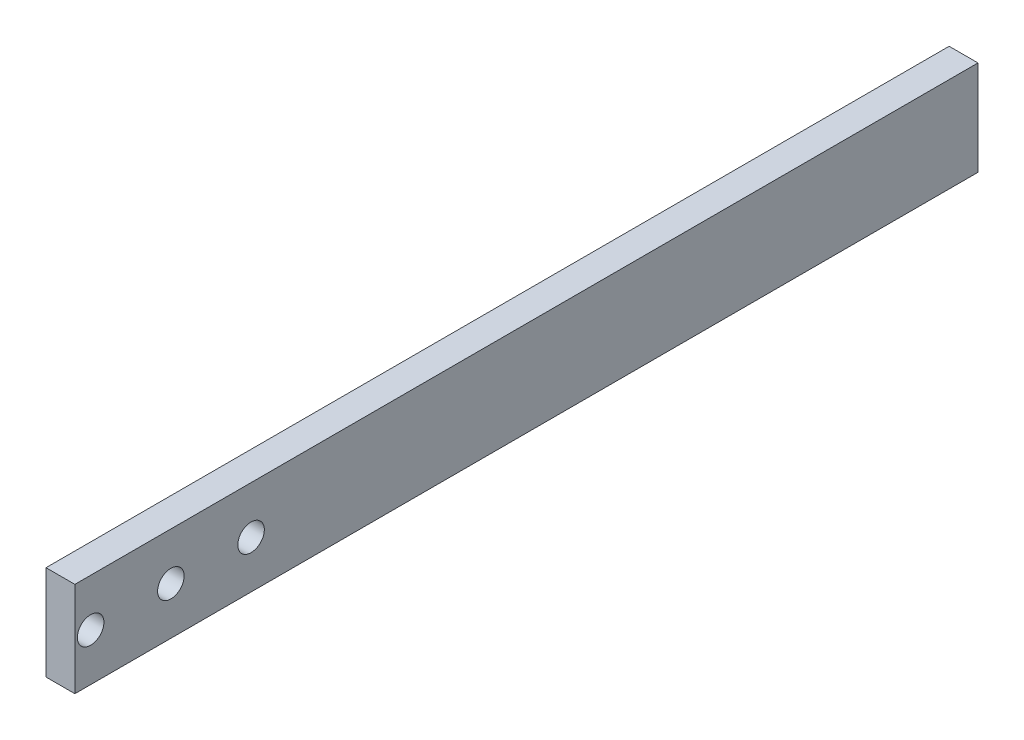
ISO-10303-21;
HEADER;
FILE_DESCRIPTION(('STEP AP214'),'2;1');
FILE_NAME('part.step','',(''),(''),'','','');
FILE_SCHEMA(('AUTOMOTIVE_DESIGN { 1 0 10303 214 1 1 1 1 }'));
ENDSEC;
DATA;
#1=APPLICATION_CONTEXT('core data for automotive mechanical design processes');
#2=APPLICATION_PROTOCOL_DEFINITION('international standard','automotive_design',2000,#1);
#3=PRODUCT_CONTEXT('',#1,'mechanical');
#4=PRODUCT('Part','Part','',(#3));
#5=PRODUCT_RELATED_PRODUCT_CATEGORY('part','',(#4));
#6=PRODUCT_DEFINITION_FORMATION('','',#4);
#7=PRODUCT_DEFINITION_CONTEXT('part definition',#1,'design');
#8=PRODUCT_DEFINITION('design','',#6,#7);
#9=PRODUCT_DEFINITION_SHAPE('','',#8);
#10=(LENGTH_UNIT() NAMED_UNIT(*) SI_UNIT(.MILLI.,.METRE.));
#11=(NAMED_UNIT(*) PLANE_ANGLE_UNIT() SI_UNIT($,.RADIAN.));
#12=(NAMED_UNIT(*) SI_UNIT($,.STERADIAN.) SOLID_ANGLE_UNIT());
#13=UNCERTAINTY_MEASURE_WITH_UNIT(LENGTH_MEASURE(1.E-05),#10,'distance_accuracy_value','');
#14=(GEOMETRIC_REPRESENTATION_CONTEXT(3) GLOBAL_UNCERTAINTY_ASSIGNED_CONTEXT((#13)) GLOBAL_UNIT_ASSIGNED_CONTEXT((#10,
#11,#12)) REPRESENTATION_CONTEXT('',''));
#15=CARTESIAN_POINT('',(0.,0.,0.));
#16=DIRECTION('',(0.,0.,1.));
#17=DIRECTION('',(1.,0.,0.));
#18=AXIS2_PLACEMENT_3D('',#15,#16,#17);
#19=CARTESIAN_POINT('',(-45.43,18.,-125.));
#20=DIRECTION('',(0.,0.,-1.));
#21=DIRECTION('',(-1.,0.,0.));
#22=AXIS2_PLACEMENT_3D('',#19,#20,#21);
#23=PLANE('',#22);
#24=DIRECTION('',(0.,-1.,0.));
#25=VECTOR('',#24,1.);
#26=CARTESIAN_POINT('',(-50.,18.,-125.));
#27=LINE('',#26,#25);
#28=CARTESIAN_POINT('',(-50.,18.,-125.));
#29=VERTEX_POINT('',#28);
#30=CARTESIAN_POINT('',(-50.,2.99999999999999,-125.));
#31=VERTEX_POINT('',#30);
#32=EDGE_CURVE('E98',#29,#31,#27,.T.);
#33=ORIENTED_EDGE('',*,*,#32,.T.);
#34=DIRECTION('',(-1.,0.,0.));
#35=VECTOR('',#34,1.);
#36=CARTESIAN_POINT('',(-40.,3.,-125.));
#37=LINE('',#36,#35);
#38=CARTESIAN_POINT('',(-45.43,3.,-125.));
#39=VERTEX_POINT('',#38);
#40=EDGE_CURVE('E55',#39,#31,#37,.T.);
#41=ORIENTED_EDGE('',*,*,#40,.F.);
#42=DIRECTION('',(0.,-1.,0.));
#43=VECTOR('',#42,1.);
#44=CARTESIAN_POINT('',(-45.43,18.,-125.));
#45=LINE('',#44,#43);
#46=CARTESIAN_POINT('',(-45.43,18.,-125.));
#47=VERTEX_POINT('',#46);
#48=EDGE_CURVE('E11',#47,#39,#45,.T.);
#49=ORIENTED_EDGE('',*,*,#48,.F.);
#50=DIRECTION('',(1.,0.,0.));
#51=VECTOR('',#50,1.);
#52=CARTESIAN_POINT('',(-45.43,18.,-125.));
#53=LINE('',#52,#51);
#54=EDGE_CURVE('E107',#29,#47,#53,.T.);
#55=ORIENTED_EDGE('',*,*,#54,.F.);
#56=EDGE_LOOP('',(#33,#41,#49,#55));
#57=FACE_BOUND('',#56,.T.);
#58=ADVANCED_FACE('F41',(#57),#23,.F.);
#59=CARTESIAN_POINT('',(-45.43,18.,-268.));
#60=DIRECTION('',(-1.,0.,0.));
#61=DIRECTION('',(0.,0.,1.));
#62=AXIS2_PLACEMENT_3D('',#59,#60,#61);
#63=PLANE('',#62);
#64=CARTESIAN_POINT('',(-45.43,10.5,-127.5));
#65=DIRECTION('',(-1.,0.,0.));
#66=DIRECTION('',(0.,0.,1.));
#67=AXIS2_PLACEMENT_3D('',#64,#65,#66);
#68=CIRCLE('',#67,2.09999999999999);
#69=CARTESIAN_POINT('',(-45.43,10.5,-125.4));
#70=VERTEX_POINT('',#69);
#71=EDGE_CURVE('E109',#70,#70,#68,.T.);
#72=ORIENTED_EDGE('',*,*,#71,.T.);
#73=EDGE_LOOP('',(#72));
#74=FACE_BOUND('',#73,.T.);
#75=CARTESIAN_POINT('',(-45.43,10.5,-140.2));
#76=DIRECTION('',(-1.,0.,0.));
#77=DIRECTION('',(0.,0.,1.));
#78=AXIS2_PLACEMENT_3D('',#75,#76,#77);
#79=CIRCLE('',#78,2.09999999999999);
#80=CARTESIAN_POINT('',(-45.43,10.5,-138.1));
#81=VERTEX_POINT('',#80);
#82=EDGE_CURVE('E112',#81,#81,#79,.T.);
#83=ORIENTED_EDGE('',*,*,#82,.T.);
#84=EDGE_LOOP('',(#83));
#85=FACE_BOUND('',#84,.T.);
#86=CARTESIAN_POINT('',(-45.43,10.5,-152.9));
#87=DIRECTION('',(-1.,0.,0.));
#88=DIRECTION('',(0.,0.,1.));
#89=AXIS2_PLACEMENT_3D('',#86,#87,#88);
#90=CIRCLE('',#89,2.09999999999999);
#91=CARTESIAN_POINT('',(-45.43,10.5,-150.8));
#92=VERTEX_POINT('',#91);
#93=EDGE_CURVE('E115',#92,#92,#90,.T.);
#94=ORIENTED_EDGE('',*,*,#93,.T.);
#95=EDGE_LOOP('',(#94));
#96=FACE_BOUND('',#95,.T.);
#97=ORIENTED_EDGE('',*,*,#48,.T.);
#98=DIRECTION('',(0.,0.,-1.));
#99=VECTOR('',#98,1.);
#100=CARTESIAN_POINT('',(-45.43,2.99999999999998,-268.));
#101=LINE('',#100,#99);
#102=CARTESIAN_POINT('',(-45.43,2.99999999999998,-268.));
#103=VERTEX_POINT('',#102);
#104=EDGE_CURVE('E95',#39,#103,#101,.T.);
#105=ORIENTED_EDGE('',*,*,#104,.T.);
#106=DIRECTION('',(0.,-1.,0.));
#107=VECTOR('',#106,1.);
#108=CARTESIAN_POINT('',(-45.43,18.,-268.));
#109=LINE('',#108,#107);
#110=CARTESIAN_POINT('',(-45.43,18.,-268.));
#111=VERTEX_POINT('',#110);
#112=EDGE_CURVE('E48',#111,#103,#109,.T.);
#113=ORIENTED_EDGE('',*,*,#112,.F.);
#114=DIRECTION('',(0.,0.,-1.));
#115=VECTOR('',#114,1.);
#116=CARTESIAN_POINT('',(-45.43,18.,-268.));
#117=LINE('',#116,#115);
#118=EDGE_CURVE('E105',#47,#111,#117,.T.);
#119=ORIENTED_EDGE('',*,*,#118,.F.);
#120=EDGE_LOOP('',(#97,#105,#113,#119));
#121=FACE_BOUND('',#120,.T.);
#122=ADVANCED_FACE('F129',(#74,#85,#96,#121),#63,.F.);
#123=CARTESIAN_POINT('',(-50.,18.,-268.));
#124=DIRECTION('',(0.,0.,1.));
#125=DIRECTION('',(1.,0.,0.));
#126=AXIS2_PLACEMENT_3D('',#123,#124,#125);
#127=PLANE('',#126);
#128=ORIENTED_EDGE('',*,*,#112,.T.);
#129=DIRECTION('',(-1.,0.,0.));
#130=VECTOR('',#129,1.);
#131=CARTESIAN_POINT('',(-50.,2.99999999999998,-268.));
#132=LINE('',#131,#130);
#133=CARTESIAN_POINT('',(-50.,2.99999999999998,-268.));
#134=VERTEX_POINT('',#133);
#135=EDGE_CURVE('E82',#103,#134,#132,.T.);
#136=ORIENTED_EDGE('',*,*,#135,.T.);
#137=DIRECTION('',(0.,-1.,0.));
#138=VECTOR('',#137,1.);
#139=CARTESIAN_POINT('',(-50.,18.,-268.));
#140=LINE('',#139,#138);
#141=CARTESIAN_POINT('',(-50.,18.,-268.));
#142=VERTEX_POINT('',#141);
#143=EDGE_CURVE('E93',#142,#134,#140,.T.);
#144=ORIENTED_EDGE('',*,*,#143,.F.);
#145=DIRECTION('',(-1.,0.,0.));
#146=VECTOR('',#145,1.);
#147=CARTESIAN_POINT('',(-50.,18.,-268.));
#148=LINE('',#147,#146);
#149=EDGE_CURVE('E103',#111,#142,#148,.T.);
#150=ORIENTED_EDGE('',*,*,#149,.F.);
#151=EDGE_LOOP('',(#128,#136,#144,#150));
#152=FACE_BOUND('',#151,.T.);
#153=ADVANCED_FACE('F91',(#152),#127,.F.);
#154=CARTESIAN_POINT('',(-50.,18.,-268.));
#155=DIRECTION('',(1.,0.,0.));
#156=DIRECTION('',(0.,0.,-1.));
#157=AXIS2_PLACEMENT_3D('',#154,#155,#156);
#158=PLANE('',#157);
#159=CARTESIAN_POINT('',(-50.,10.5,-127.5));
#160=DIRECTION('',(-1.,0.,0.));
#161=DIRECTION('',(0.,0.,1.));
#162=AXIS2_PLACEMENT_3D('',#159,#160,#161);
#163=CIRCLE('',#162,2.09999999999999);
#164=CARTESIAN_POINT('',(-50.,10.5,-125.4));
#165=VERTEX_POINT('',#164);
#166=EDGE_CURVE('E118',#165,#165,#163,.T.);
#167=ORIENTED_EDGE('',*,*,#166,.F.);
#168=EDGE_LOOP('',(#167));
#169=FACE_BOUND('',#168,.T.);
#170=CARTESIAN_POINT('',(-50.,10.5,-140.2));
#171=DIRECTION('',(-1.,0.,0.));
#172=DIRECTION('',(0.,0.,1.));
#173=AXIS2_PLACEMENT_3D('',#170,#171,#172);
#174=CIRCLE('',#173,2.09999999999999);
#175=CARTESIAN_POINT('',(-50.,10.5,-138.1));
#176=VERTEX_POINT('',#175);
#177=EDGE_CURVE('E122',#176,#176,#174,.T.);
#178=ORIENTED_EDGE('',*,*,#177,.F.);
#179=EDGE_LOOP('',(#178));
#180=FACE_BOUND('',#179,.T.);
#181=CARTESIAN_POINT('',(-50.,10.5,-152.9));
#182=DIRECTION('',(-1.,0.,0.));
#183=DIRECTION('',(0.,0.,1.));
#184=AXIS2_PLACEMENT_3D('',#181,#182,#183);
#185=CIRCLE('',#184,2.09999999999999);
#186=CARTESIAN_POINT('',(-50.,10.5,-150.8));
#187=VERTEX_POINT('',#186);
#188=EDGE_CURVE('E119',#187,#187,#185,.T.);
#189=ORIENTED_EDGE('',*,*,#188,.F.);
#190=EDGE_LOOP('',(#189));
#191=FACE_BOUND('',#190,.T.);
#192=ORIENTED_EDGE('',*,*,#143,.T.);
#193=DIRECTION('',(0.,0.,-1.));
#194=VECTOR('',#193,1.);
#195=CARTESIAN_POINT('',(-50.,3.,-125.));
#196=LINE('',#195,#194);
#197=EDGE_CURVE('E79',#31,#134,#196,.T.);
#198=ORIENTED_EDGE('',*,*,#197,.F.);
#199=ORIENTED_EDGE('',*,*,#32,.F.);
#200=DIRECTION('',(0.,0.,1.));
#201=VECTOR('',#200,1.);
#202=CARTESIAN_POINT('',(-50.,18.,-268.));
#203=LINE('',#202,#201);
#204=EDGE_CURVE('E63',#142,#29,#203,.T.);
#205=ORIENTED_EDGE('',*,*,#204,.F.);
#206=EDGE_LOOP('',(#192,#198,#199,#205));
#207=FACE_BOUND('',#206,.T.);
#208=ADVANCED_FACE('F97',(#169,#180,#191,#207),#158,.F.);
#209=CARTESIAN_POINT('',(0.,18.,0.));
#210=DIRECTION('',(0.,1.,0.));
#211=DIRECTION('',(0.,0.,1.));
#212=AXIS2_PLACEMENT_3D('',#209,#210,#211);
#213=PLANE('',#212);
#214=ORIENTED_EDGE('',*,*,#54,.T.);
#215=ORIENTED_EDGE('',*,*,#118,.T.);
#216=ORIENTED_EDGE('',*,*,#149,.T.);
#217=ORIENTED_EDGE('',*,*,#204,.T.);
#218=EDGE_LOOP('',(#214,#215,#216,#217));
#219=FACE_BOUND('',#218,.T.);
#220=ADVANCED_FACE('F133',(#219),#213,.T.);
#221=CARTESIAN_POINT('',(-32.,10.5,-152.9));
#222=DIRECTION('',(-1.,0.,0.));
#223=DIRECTION('',(0.,0.,1.));
#224=AXIS2_PLACEMENT_3D('',#221,#222,#223);
#225=CYLINDRICAL_SURFACE('',#224,2.09999999999999);
#226=ORIENTED_EDGE('',*,*,#188,.T.);
#227=EDGE_LOOP('',(#226));
#228=FACE_BOUND('',#227,.T.);
#229=ORIENTED_EDGE('',*,*,#93,.F.);
#230=EDGE_LOOP('',(#229));
#231=FACE_BOUND('',#230,.T.);
#232=ADVANCED_FACE('F135',(#228,#231),#225,.F.);
#233=CARTESIAN_POINT('',(-32.,10.5,-140.2));
#234=DIRECTION('',(-1.,0.,0.));
#235=DIRECTION('',(0.,0.,1.));
#236=AXIS2_PLACEMENT_3D('',#233,#234,#235);
#237=CYLINDRICAL_SURFACE('',#236,2.09999999999999);
#238=ORIENTED_EDGE('',*,*,#177,.T.);
#239=EDGE_LOOP('',(#238));
#240=FACE_BOUND('',#239,.T.);
#241=ORIENTED_EDGE('',*,*,#82,.F.);
#242=EDGE_LOOP('',(#241));
#243=FACE_BOUND('',#242,.T.);
#244=ADVANCED_FACE('F140',(#240,#243),#237,.F.);
#245=CARTESIAN_POINT('',(-32.,10.5,-127.5));
#246=DIRECTION('',(-1.,0.,0.));
#247=DIRECTION('',(0.,0.,1.));
#248=AXIS2_PLACEMENT_3D('',#245,#246,#247);
#249=CYLINDRICAL_SURFACE('',#248,2.09999999999999);
#250=ORIENTED_EDGE('',*,*,#166,.T.);
#251=EDGE_LOOP('',(#250));
#252=FACE_BOUND('',#251,.T.);
#253=ORIENTED_EDGE('',*,*,#71,.F.);
#254=EDGE_LOOP('',(#253));
#255=FACE_BOUND('',#254,.T.);
#256=ADVANCED_FACE('F164',(#252,#255),#249,.F.);
#257=CARTESIAN_POINT('',(-40.,3.,-125.));
#258=DIRECTION('',(0.,1.,0.));
#259=DIRECTION('',(0.,0.,1.));
#260=AXIS2_PLACEMENT_3D('',#257,#258,#259);
#261=PLANE('',#260);
#262=ORIENTED_EDGE('',*,*,#40,.T.);
#263=ORIENTED_EDGE('',*,*,#197,.T.);
#264=ORIENTED_EDGE('',*,*,#135,.F.);
#265=ORIENTED_EDGE('',*,*,#104,.F.);
#266=EDGE_LOOP('',(#262,#263,#264,#265));
#267=FACE_BOUND('',#266,.T.);
#268=ADVANCED_FACE('F81',(#267),#261,.F.);
#269=CLOSED_SHELL('',(#58,#122,#153,#208,#220,#232,#244,#256,#268));
#270=MANIFOLD_SOLID_BREP('B2',#269);
#271=ADVANCED_BREP_SHAPE_REPRESENTATION('',(#18,#270),#14);
#272=SHAPE_DEFINITION_REPRESENTATION(#9,#271);
ENDSEC;
END-ISO-10303-21;
